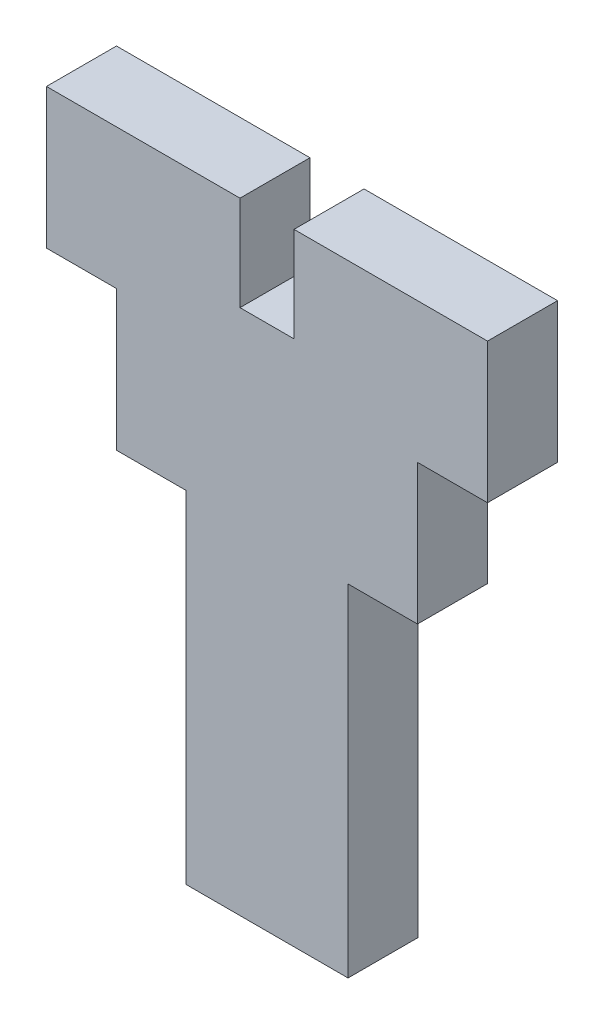
ISO-10303-21;
HEADER;
FILE_DESCRIPTION(('STEP AP214'),'2;1');
FILE_NAME('part.step','',(''),(''),'','','');
FILE_SCHEMA(('AUTOMOTIVE_DESIGN { 1 0 10303 214 1 1 1 1 }'));
ENDSEC;
DATA;
#1=APPLICATION_CONTEXT('core data for automotive mechanical design processes');
#2=APPLICATION_PROTOCOL_DEFINITION('international standard','automotive_design',2000,#1);
#3=PRODUCT_CONTEXT('',#1,'mechanical');
#4=PRODUCT('Part','Part','',(#3));
#5=PRODUCT_RELATED_PRODUCT_CATEGORY('part','',(#4));
#6=PRODUCT_DEFINITION_FORMATION('','',#4);
#7=PRODUCT_DEFINITION_CONTEXT('part definition',#1,'design');
#8=PRODUCT_DEFINITION('design','',#6,#7);
#9=PRODUCT_DEFINITION_SHAPE('','',#8);
#10=(LENGTH_UNIT() NAMED_UNIT(*) SI_UNIT(.MILLI.,.METRE.));
#11=(NAMED_UNIT(*) PLANE_ANGLE_UNIT() SI_UNIT($,.RADIAN.));
#12=(NAMED_UNIT(*) SI_UNIT($,.STERADIAN.) SOLID_ANGLE_UNIT());
#13=UNCERTAINTY_MEASURE_WITH_UNIT(LENGTH_MEASURE(1.E-05),#10,'distance_accuracy_value','');
#14=(GEOMETRIC_REPRESENTATION_CONTEXT(3) GLOBAL_UNCERTAINTY_ASSIGNED_CONTEXT((#13)) GLOBAL_UNIT_ASSIGNED_CONTEXT((#10,
#11,#12)) REPRESENTATION_CONTEXT('',''));
#15=CARTESIAN_POINT('',(0.,0.,0.));
#16=DIRECTION('',(0.,0.,1.));
#17=DIRECTION('',(1.,0.,0.));
#18=AXIS2_PLACEMENT_3D('',#15,#16,#17);
#19=CARTESIAN_POINT('',(0.,-19.05,0.));
#20=DIRECTION('',(0.,1.,0.));
#21=DIRECTION('',(0.,0.,1.));
#22=AXIS2_PLACEMENT_3D('',#19,#20,#21);
#23=PLANE('',#22);
#24=DIRECTION('',(0.,0.,1.));
#25=VECTOR('',#24,1.);
#26=CARTESIAN_POINT('',(7.35,-19.05,0.));
#27=LINE('',#26,#25);
#28=CARTESIAN_POINT('',(7.35,-19.05,0.));
#29=VERTEX_POINT('',#28);
#30=CARTESIAN_POINT('',(7.35,-19.05,6.35));
#31=VERTEX_POINT('',#30);
#32=EDGE_CURVE('E50',#29,#31,#27,.T.);
#33=ORIENTED_EDGE('',*,*,#32,.F.);
#34=DIRECTION('',(1.,0.,0.));
#35=VECTOR('',#34,1.);
#36=CARTESIAN_POINT('',(-13.65,-19.05,0.));
#37=LINE('',#36,#35);
#38=CARTESIAN_POINT('',(13.65,-19.05,0.));
#39=VERTEX_POINT('',#38);
#40=EDGE_CURVE('E194',#29,#39,#37,.T.);
#41=ORIENTED_EDGE('',*,*,#40,.T.);
#42=DIRECTION('',(0.,0.,1.));
#43=VECTOR('',#42,1.);
#44=CARTESIAN_POINT('',(13.65,-19.05,0.));
#45=LINE('',#44,#43);
#46=CARTESIAN_POINT('',(13.65,-19.05,6.35));
#47=VERTEX_POINT('',#46);
#48=EDGE_CURVE('E230',#39,#47,#45,.T.);
#49=ORIENTED_EDGE('',*,*,#48,.T.);
#50=DIRECTION('',(-1.,0.,0.));
#51=VECTOR('',#50,1.);
#52=CARTESIAN_POINT('',(-13.65,-19.05,6.35));
#53=LINE('',#52,#51);
#54=EDGE_CURVE('E215',#47,#31,#53,.T.);
#55=ORIENTED_EDGE('',*,*,#54,.T.);
#56=EDGE_LOOP('',(#33,#41,#49,#55));
#57=FACE_BOUND('',#56,.T.);
#58=ADVANCED_FACE('F33',(#57),#23,.F.);
#59=DIRECTION('',(0.,0.,-1.));
#60=VECTOR('',#59,1.);
#61=CARTESIAN_POINT('',(-7.35,-19.05,0.));
#62=LINE('',#61,#60);
#63=CARTESIAN_POINT('',(-7.35,-19.05,6.35));
#64=VERTEX_POINT('',#63);
#65=CARTESIAN_POINT('',(-7.35,-19.05,0.));
#66=VERTEX_POINT('',#65);
#67=EDGE_CURVE('E58',#64,#66,#62,.T.);
#68=ORIENTED_EDGE('',*,*,#67,.F.);
#69=CARTESIAN_POINT('',(-13.65,-19.05,6.35));
#70=VERTEX_POINT('',#69);
#71=EDGE_CURVE('E219',#64,#70,#53,.T.);
#72=ORIENTED_EDGE('',*,*,#71,.T.);
#73=DIRECTION('',(0.,0.,-1.));
#74=VECTOR('',#73,1.);
#75=CARTESIAN_POINT('',(-13.65,-19.05,0.));
#76=LINE('',#75,#74);
#77=CARTESIAN_POINT('',(-13.65,-19.05,0.));
#78=VERTEX_POINT('',#77);
#79=EDGE_CURVE('E214',#70,#78,#76,.T.);
#80=ORIENTED_EDGE('',*,*,#79,.T.);
#81=EDGE_CURVE('E213',#78,#66,#37,.T.);
#82=ORIENTED_EDGE('',*,*,#81,.T.);
#83=EDGE_LOOP('',(#68,#72,#80,#82));
#84=FACE_BOUND('',#83,.T.);
#85=ADVANCED_FACE('F356',(#84),#23,.F.);
#86=CARTESIAN_POINT('',(-20.,6.35,6.35));
#87=DIRECTION('',(0.,-1.,0.));
#88=DIRECTION('',(0.,0.,-1.));
#89=AXIS2_PLACEMENT_3D('',#86,#87,#88);
#90=PLANE('',#89);
#91=DIRECTION('',(-1.,0.,0.));
#92=VECTOR('',#91,1.);
#93=CARTESIAN_POINT('',(-20.,6.35,0.));
#94=LINE('',#93,#92);
#95=CARTESIAN_POINT('',(20.,6.35,0.));
#96=VERTEX_POINT('',#95);
#97=CARTESIAN_POINT('',(2.45,6.35,0.));
#98=VERTEX_POINT('',#97);
#99=EDGE_CURVE('E305',#96,#98,#94,.T.);
#100=ORIENTED_EDGE('',*,*,#99,.T.);
#101=DIRECTION('',(0.,0.,-1.));
#102=VECTOR('',#101,1.);
#103=CARTESIAN_POINT('',(2.45,6.35,6.35));
#104=LINE('',#103,#102);
#105=CARTESIAN_POINT('',(2.45,6.35,6.35));
#106=VERTEX_POINT('',#105);
#107=EDGE_CURVE('E170',#106,#98,#104,.T.);
#108=ORIENTED_EDGE('',*,*,#107,.F.);
#109=DIRECTION('',(-1.,0.,0.));
#110=VECTOR('',#109,1.);
#111=CARTESIAN_POINT('',(-20.,6.35,6.35));
#112=LINE('',#111,#110);
#113=CARTESIAN_POINT('',(20.,6.35,6.35));
#114=VERTEX_POINT('',#113);
#115=EDGE_CURVE('E268',#114,#106,#112,.T.);
#116=ORIENTED_EDGE('',*,*,#115,.F.);
#117=DIRECTION('',(0.,0.,-1.));
#118=VECTOR('',#117,1.);
#119=CARTESIAN_POINT('',(20.,6.35,6.35));
#120=LINE('',#119,#118);
#121=EDGE_CURVE('E11',#114,#96,#120,.T.);
#122=ORIENTED_EDGE('',*,*,#121,.T.);
#123=EDGE_LOOP('',(#100,#108,#116,#122));
#124=FACE_BOUND('',#123,.T.);
#125=ADVANCED_FACE('F319',(#124),#90,.F.);
#126=CARTESIAN_POINT('',(-20.,-6.35,6.35));
#127=DIRECTION('',(0.,1.,0.));
#128=DIRECTION('',(0.,0.,1.));
#129=AXIS2_PLACEMENT_3D('',#126,#127,#128);
#130=PLANE('',#129);
#131=DIRECTION('',(0.,0.,1.));
#132=VECTOR('',#131,1.);
#133=CARTESIAN_POINT('',(13.65,-6.35,0.));
#134=LINE('',#133,#132);
#135=CARTESIAN_POINT('',(13.65,-6.35,0.));
#136=VERTEX_POINT('',#135);
#137=CARTESIAN_POINT('',(13.65,-6.35,6.35));
#138=VERTEX_POINT('',#137);
#139=EDGE_CURVE('E236',#136,#138,#134,.T.);
#140=ORIENTED_EDGE('',*,*,#139,.F.);
#141=DIRECTION('',(1.,0.,0.));
#142=VECTOR('',#141,1.);
#143=CARTESIAN_POINT('',(-20.,-6.35,0.));
#144=LINE('',#143,#142);
#145=CARTESIAN_POINT('',(20.,-6.35,0.));
#146=VERTEX_POINT('',#145);
#147=EDGE_CURVE('E279',#136,#146,#144,.T.);
#148=ORIENTED_EDGE('',*,*,#147,.T.);
#149=DIRECTION('',(0.,0.,-1.));
#150=VECTOR('',#149,1.);
#151=CARTESIAN_POINT('',(20.,-6.35,6.35));
#152=LINE('',#151,#150);
#153=CARTESIAN_POINT('',(20.,-6.35,6.35));
#154=VERTEX_POINT('',#153);
#155=EDGE_CURVE('E278',#154,#146,#152,.T.);
#156=ORIENTED_EDGE('',*,*,#155,.F.);
#157=DIRECTION('',(1.,0.,0.));
#158=VECTOR('',#157,1.);
#159=CARTESIAN_POINT('',(-20.,-6.35,6.35));
#160=LINE('',#159,#158);
#161=EDGE_CURVE('E258',#138,#154,#160,.T.);
#162=ORIENTED_EDGE('',*,*,#161,.F.);
#163=EDGE_LOOP('',(#140,#148,#156,#162));
#164=FACE_BOUND('',#163,.T.);
#165=ADVANCED_FACE('F323',(#164),#130,.F.);
#166=DIRECTION('',(0.,0.,-1.));
#167=VECTOR('',#166,1.);
#168=CARTESIAN_POINT('',(-13.65,-6.35,0.));
#169=LINE('',#168,#167);
#170=CARTESIAN_POINT('',(-13.65,-6.35,6.35));
#171=VERTEX_POINT('',#170);
#172=CARTESIAN_POINT('',(-13.65,-6.35,0.));
#173=VERTEX_POINT('',#172);
#174=EDGE_CURVE('E239',#171,#173,#169,.T.);
#175=ORIENTED_EDGE('',*,*,#174,.F.);
#176=CARTESIAN_POINT('',(-20.,-6.35,6.35));
#177=VERTEX_POINT('',#176);
#178=EDGE_CURVE('E275',#177,#171,#160,.T.);
#179=ORIENTED_EDGE('',*,*,#178,.F.);
#180=DIRECTION('',(0.,0.,-1.));
#181=VECTOR('',#180,1.);
#182=CARTESIAN_POINT('',(-20.,-6.35,6.35));
#183=LINE('',#182,#181);
#184=CARTESIAN_POINT('',(-20.,-6.35,0.));
#185=VERTEX_POINT('',#184);
#186=EDGE_CURVE('E289',#177,#185,#183,.T.);
#187=ORIENTED_EDGE('',*,*,#186,.T.);
#188=EDGE_CURVE('E267',#185,#173,#144,.T.);
#189=ORIENTED_EDGE('',*,*,#188,.T.);
#190=EDGE_LOOP('',(#175,#179,#187,#189));
#191=FACE_BOUND('',#190,.T.);
#192=ADVANCED_FACE('F353',(#191),#130,.F.);
#193=CARTESIAN_POINT('',(20.,-6.35,6.35));
#194=DIRECTION('',(-1.,0.,0.));
#195=DIRECTION('',(0.,0.,1.));
#196=AXIS2_PLACEMENT_3D('',#193,#194,#195);
#197=PLANE('',#196);
#198=DIRECTION('',(0.,1.,0.));
#199=VECTOR('',#198,1.);
#200=CARTESIAN_POINT('',(20.,-6.35,0.));
#201=LINE('',#200,#199);
#202=EDGE_CURVE('E246',#146,#96,#201,.T.);
#203=ORIENTED_EDGE('',*,*,#202,.T.);
#204=ORIENTED_EDGE('',*,*,#121,.F.);
#205=DIRECTION('',(0.,1.,0.));
#206=VECTOR('',#205,1.);
#207=CARTESIAN_POINT('',(20.,-6.35,6.35));
#208=LINE('',#207,#206);
#209=EDGE_CURVE('E263',#154,#114,#208,.T.);
#210=ORIENTED_EDGE('',*,*,#209,.F.);
#211=ORIENTED_EDGE('',*,*,#155,.T.);
#212=EDGE_LOOP('',(#203,#204,#210,#211));
#213=FACE_BOUND('',#212,.T.);
#214=ADVANCED_FACE('F35',(#213),#197,.F.);
#215=CARTESIAN_POINT('',(-2.45,6.35,6.35));
#216=VERTEX_POINT('',#215);
#217=CARTESIAN_POINT('',(-20.,6.35,6.35));
#218=VERTEX_POINT('',#217);
#219=EDGE_CURVE('E266',#216,#218,#112,.T.);
#220=ORIENTED_EDGE('',*,*,#219,.F.);
#221=DIRECTION('',(0.,0.,1.));
#222=VECTOR('',#221,1.);
#223=CARTESIAN_POINT('',(-2.45,6.35,6.35));
#224=LINE('',#223,#222);
#225=CARTESIAN_POINT('',(-2.45,6.35,0.));
#226=VERTEX_POINT('',#225);
#227=EDGE_CURVE('E172',#226,#216,#224,.T.);
#228=ORIENTED_EDGE('',*,*,#227,.F.);
#229=CARTESIAN_POINT('',(-20.,6.35,0.));
#230=VERTEX_POINT('',#229);
#231=EDGE_CURVE('E304',#226,#230,#94,.T.);
#232=ORIENTED_EDGE('',*,*,#231,.T.);
#233=DIRECTION('',(0.,0.,-1.));
#234=VECTOR('',#233,1.);
#235=CARTESIAN_POINT('',(-20.,6.35,6.35));
#236=LINE('',#235,#234);
#237=EDGE_CURVE('E42',#218,#230,#236,.T.);
#238=ORIENTED_EDGE('',*,*,#237,.F.);
#239=EDGE_LOOP('',(#220,#228,#232,#238));
#240=FACE_BOUND('',#239,.T.);
#241=ADVANCED_FACE('F349',(#240),#90,.F.);
#242=CARTESIAN_POINT('',(-20.,-6.35,6.35));
#243=DIRECTION('',(1.,0.,0.));
#244=DIRECTION('',(0.,0.,-1.));
#245=AXIS2_PLACEMENT_3D('',#242,#243,#244);
#246=PLANE('',#245);
#247=DIRECTION('',(0.,-1.,0.));
#248=VECTOR('',#247,1.);
#249=CARTESIAN_POINT('',(-20.,-6.35,0.));
#250=LINE('',#249,#248);
#251=EDGE_CURVE('E282',#230,#185,#250,.T.);
#252=ORIENTED_EDGE('',*,*,#251,.T.);
#253=ORIENTED_EDGE('',*,*,#186,.F.);
#254=DIRECTION('',(0.,-1.,0.));
#255=VECTOR('',#254,1.);
#256=CARTESIAN_POINT('',(-20.,-6.35,6.35));
#257=LINE('',#256,#255);
#258=EDGE_CURVE('E270',#218,#177,#257,.T.);
#259=ORIENTED_EDGE('',*,*,#258,.F.);
#260=ORIENTED_EDGE('',*,*,#237,.T.);
#261=EDGE_LOOP('',(#252,#253,#259,#260));
#262=FACE_BOUND('',#261,.T.);
#263=ADVANCED_FACE('F297',(#262),#246,.F.);
#264=CARTESIAN_POINT('',(0.,0.,6.35));
#265=DIRECTION('',(0.,0.,-1.));
#266=DIRECTION('',(-1.,0.,0.));
#267=AXIS2_PLACEMENT_3D('',#264,#265,#266);
#268=PLANE('',#267);
#269=ORIENTED_EDGE('',*,*,#115,.T.);
#270=DIRECTION('',(0.,1.,0.));
#271=VECTOR('',#270,1.);
#272=CARTESIAN_POINT('',(2.45,-2.25,6.35));
#273=LINE('',#272,#271);
#274=CARTESIAN_POINT('',(2.45,-2.25,6.35));
#275=VERTEX_POINT('',#274);
#276=EDGE_CURVE('E240',#275,#106,#273,.T.);
#277=ORIENTED_EDGE('',*,*,#276,.F.);
#278=DIRECTION('',(1.,0.,0.));
#279=VECTOR('',#278,1.);
#280=CARTESIAN_POINT('',(-2.45,-2.25,6.35));
#281=LINE('',#280,#279);
#282=CARTESIAN_POINT('',(-2.45,-2.25,6.35));
#283=VERTEX_POINT('',#282);
#284=EDGE_CURVE('E329',#283,#275,#281,.T.);
#285=ORIENTED_EDGE('',*,*,#284,.F.);
#286=DIRECTION('',(0.,1.,0.));
#287=VECTOR('',#286,1.);
#288=CARTESIAN_POINT('',(-2.45,-2.25,6.35));
#289=LINE('',#288,#287);
#290=EDGE_CURVE('E331',#283,#216,#289,.T.);
#291=ORIENTED_EDGE('',*,*,#290,.T.);
#292=ORIENTED_EDGE('',*,*,#219,.T.);
#293=ORIENTED_EDGE('',*,*,#258,.T.);
#294=ORIENTED_EDGE('',*,*,#178,.T.);
#295=DIRECTION('',(0.,1.,0.));
#296=VECTOR('',#295,1.);
#297=CARTESIAN_POINT('',(-13.65,-19.05,6.35));
#298=LINE('',#297,#296);
#299=EDGE_CURVE('E247',#70,#171,#298,.T.);
#300=ORIENTED_EDGE('',*,*,#299,.F.);
#301=ORIENTED_EDGE('',*,*,#71,.F.);
#302=DIRECTION('',(0.,1.,0.));
#303=VECTOR('',#302,1.);
#304=CARTESIAN_POINT('',(-7.35,-50.,6.35));
#305=LINE('',#304,#303);
#306=CARTESIAN_POINT('',(-7.35,-50.,6.35));
#307=VERTEX_POINT('',#306);
#308=EDGE_CURVE('E155',#307,#64,#305,.T.);
#309=ORIENTED_EDGE('',*,*,#308,.F.);
#310=DIRECTION('',(-1.,0.,0.));
#311=VECTOR('',#310,1.);
#312=CARTESIAN_POINT('',(-7.35,-50.,6.35));
#313=LINE('',#312,#311);
#314=CARTESIAN_POINT('',(7.35,-50.,6.35));
#315=VERTEX_POINT('',#314);
#316=EDGE_CURVE('E148',#315,#307,#313,.T.);
#317=ORIENTED_EDGE('',*,*,#316,.F.);
#318=DIRECTION('',(0.,1.,0.));
#319=VECTOR('',#318,1.);
#320=CARTESIAN_POINT('',(7.35,-50.,6.35));
#321=LINE('',#320,#319);
#322=EDGE_CURVE('E153',#315,#31,#321,.T.);
#323=ORIENTED_EDGE('',*,*,#322,.T.);
#324=ORIENTED_EDGE('',*,*,#54,.F.);
#325=DIRECTION('',(0.,1.,0.));
#326=VECTOR('',#325,1.);
#327=CARTESIAN_POINT('',(13.65,-19.05,6.35));
#328=LINE('',#327,#326);
#329=EDGE_CURVE('E243',#47,#138,#328,.T.);
#330=ORIENTED_EDGE('',*,*,#329,.T.);
#331=ORIENTED_EDGE('',*,*,#161,.T.);
#332=ORIENTED_EDGE('',*,*,#209,.T.);
#333=EDGE_LOOP('',(#269,#277,#285,#291,#292,#293,#294,#300,#301,#309,#317,#323,#324,#330,#331,#332));
#334=FACE_BOUND('',#333,.T.);
#335=ADVANCED_FACE('F151',(#334),#268,.F.);
#336=CARTESIAN_POINT('',(0.,0.,0.));
#337=DIRECTION('',(0.,0.,-1.));
#338=DIRECTION('',(-1.,0.,0.));
#339=AXIS2_PLACEMENT_3D('',#336,#337,#338);
#340=PLANE('',#339);
#341=DIRECTION('',(0.,1.,0.));
#342=VECTOR('',#341,1.);
#343=CARTESIAN_POINT('',(2.45,-2.25,0.));
#344=LINE('',#343,#342);
#345=CARTESIAN_POINT('',(2.45,-2.25,0.));
#346=VERTEX_POINT('',#345);
#347=EDGE_CURVE('E318',#346,#98,#344,.T.);
#348=ORIENTED_EDGE('',*,*,#347,.T.);
#349=ORIENTED_EDGE('',*,*,#99,.F.);
#350=ORIENTED_EDGE('',*,*,#202,.F.);
#351=ORIENTED_EDGE('',*,*,#147,.F.);
#352=DIRECTION('',(0.,1.,0.));
#353=VECTOR('',#352,1.);
#354=CARTESIAN_POINT('',(13.65,-19.05,0.));
#355=LINE('',#354,#353);
#356=EDGE_CURVE('E210',#39,#136,#355,.T.);
#357=ORIENTED_EDGE('',*,*,#356,.F.);
#358=ORIENTED_EDGE('',*,*,#40,.F.);
#359=DIRECTION('',(0.,1.,0.));
#360=VECTOR('',#359,1.);
#361=CARTESIAN_POINT('',(7.35,-50.,0.));
#362=LINE('',#361,#360);
#363=CARTESIAN_POINT('',(7.35,-50.,0.));
#364=VERTEX_POINT('',#363);
#365=EDGE_CURVE('E182',#364,#29,#362,.T.);
#366=ORIENTED_EDGE('',*,*,#365,.F.);
#367=DIRECTION('',(1.,0.,0.));
#368=VECTOR('',#367,1.);
#369=CARTESIAN_POINT('',(-7.35,-50.,0.));
#370=LINE('',#369,#368);
#371=CARTESIAN_POINT('',(-7.35,-50.,0.));
#372=VERTEX_POINT('',#371);
#373=EDGE_CURVE('E164',#372,#364,#370,.T.);
#374=ORIENTED_EDGE('',*,*,#373,.F.);
#375=DIRECTION('',(0.,1.,0.));
#376=VECTOR('',#375,1.);
#377=CARTESIAN_POINT('',(-7.35,-50.,0.));
#378=LINE('',#377,#376);
#379=EDGE_CURVE('E174',#372,#66,#378,.T.);
#380=ORIENTED_EDGE('',*,*,#379,.T.);
#381=ORIENTED_EDGE('',*,*,#81,.F.);
#382=DIRECTION('',(0.,1.,0.));
#383=VECTOR('',#382,1.);
#384=CARTESIAN_POINT('',(-13.65,-19.05,0.));
#385=LINE('',#384,#383);
#386=EDGE_CURVE('E235',#78,#173,#385,.T.);
#387=ORIENTED_EDGE('',*,*,#386,.T.);
#388=ORIENTED_EDGE('',*,*,#188,.F.);
#389=ORIENTED_EDGE('',*,*,#251,.F.);
#390=ORIENTED_EDGE('',*,*,#231,.F.);
#391=DIRECTION('',(0.,1.,0.));
#392=VECTOR('',#391,1.);
#393=CARTESIAN_POINT('',(-2.45,-2.25,0.));
#394=LINE('',#393,#392);
#395=CARTESIAN_POINT('',(-2.45,-2.25,0.));
#396=VERTEX_POINT('',#395);
#397=EDGE_CURVE('E328',#396,#226,#394,.T.);
#398=ORIENTED_EDGE('',*,*,#397,.F.);
#399=DIRECTION('',(-1.,0.,0.));
#400=VECTOR('',#399,1.);
#401=CARTESIAN_POINT('',(-2.45,-2.25,0.));
#402=LINE('',#401,#400);
#403=EDGE_CURVE('E340',#346,#396,#402,.T.);
#404=ORIENTED_EDGE('',*,*,#403,.F.);
#405=EDGE_LOOP('',(#348,#349,#350,#351,#357,#358,#366,#374,#380,#381,#387,#388,#389,#390,#398,#404));
#406=FACE_BOUND('',#405,.T.);
#407=ADVANCED_FACE('F206',(#406),#340,.T.);
#408=CARTESIAN_POINT('',(13.65,-19.05,0.));
#409=DIRECTION('',(-1.,0.,0.));
#410=DIRECTION('',(0.,0.,1.));
#411=AXIS2_PLACEMENT_3D('',#408,#409,#410);
#412=PLANE('',#411);
#413=ORIENTED_EDGE('',*,*,#139,.T.);
#414=ORIENTED_EDGE('',*,*,#329,.F.);
#415=ORIENTED_EDGE('',*,*,#48,.F.);
#416=ORIENTED_EDGE('',*,*,#356,.T.);
#417=EDGE_LOOP('',(#413,#414,#415,#416));
#418=FACE_BOUND('',#417,.T.);
#419=ADVANCED_FACE('F325',(#418),#412,.F.);
#420=CARTESIAN_POINT('',(-13.65,-19.05,0.));
#421=DIRECTION('',(1.,0.,0.));
#422=DIRECTION('',(0.,0.,-1.));
#423=AXIS2_PLACEMENT_3D('',#420,#421,#422);
#424=PLANE('',#423);
#425=ORIENTED_EDGE('',*,*,#174,.T.);
#426=ORIENTED_EDGE('',*,*,#386,.F.);
#427=ORIENTED_EDGE('',*,*,#79,.F.);
#428=ORIENTED_EDGE('',*,*,#299,.T.);
#429=EDGE_LOOP('',(#425,#426,#427,#428));
#430=FACE_BOUND('',#429,.T.);
#431=ADVANCED_FACE('F355',(#430),#424,.F.);
#432=CARTESIAN_POINT('',(2.45,-2.25,6.35));
#433=DIRECTION('',(1.,0.,0.));
#434=DIRECTION('',(0.,0.,-1.));
#435=AXIS2_PLACEMENT_3D('',#432,#433,#434);
#436=PLANE('',#435);
#437=ORIENTED_EDGE('',*,*,#107,.T.);
#438=ORIENTED_EDGE('',*,*,#347,.F.);
#439=DIRECTION('',(0.,0.,-1.));
#440=VECTOR('',#439,1.);
#441=CARTESIAN_POINT('',(2.45,-2.25,6.35));
#442=LINE('',#441,#440);
#443=EDGE_CURVE('E189',#275,#346,#442,.T.);
#444=ORIENTED_EDGE('',*,*,#443,.F.);
#445=ORIENTED_EDGE('',*,*,#276,.T.);
#446=EDGE_LOOP('',(#437,#438,#444,#445));
#447=FACE_BOUND('',#446,.T.);
#448=ADVANCED_FACE('F346',(#447),#436,.F.);
#449=CARTESIAN_POINT('',(-2.45,-2.25,6.35));
#450=DIRECTION('',(-1.,0.,0.));
#451=DIRECTION('',(0.,0.,1.));
#452=AXIS2_PLACEMENT_3D('',#449,#450,#451);
#453=PLANE('',#452);
#454=ORIENTED_EDGE('',*,*,#227,.T.);
#455=ORIENTED_EDGE('',*,*,#290,.F.);
#456=DIRECTION('',(0.,0.,1.));
#457=VECTOR('',#456,1.);
#458=CARTESIAN_POINT('',(-2.45,-2.25,6.35));
#459=LINE('',#458,#457);
#460=EDGE_CURVE('E338',#396,#283,#459,.T.);
#461=ORIENTED_EDGE('',*,*,#460,.F.);
#462=ORIENTED_EDGE('',*,*,#397,.T.);
#463=EDGE_LOOP('',(#454,#455,#461,#462));
#464=FACE_BOUND('',#463,.T.);
#465=ADVANCED_FACE('F348',(#464),#453,.F.);
#466=CARTESIAN_POINT('',(0.,-2.25,0.));
#467=DIRECTION('',(0.,-1.,0.));
#468=DIRECTION('',(0.,0.,-1.));
#469=AXIS2_PLACEMENT_3D('',#466,#467,#468);
#470=PLANE('',#469);
#471=ORIENTED_EDGE('',*,*,#443,.T.);
#472=ORIENTED_EDGE('',*,*,#403,.T.);
#473=ORIENTED_EDGE('',*,*,#460,.T.);
#474=ORIENTED_EDGE('',*,*,#284,.T.);
#475=EDGE_LOOP('',(#471,#472,#473,#474));
#476=FACE_BOUND('',#475,.T.);
#477=ADVANCED_FACE('F343',(#476),#470,.F.);
#478=CARTESIAN_POINT('',(7.35,-50.,0.));
#479=DIRECTION('',(-1.,0.,0.));
#480=DIRECTION('',(0.,0.,1.));
#481=AXIS2_PLACEMENT_3D('',#478,#479,#480);
#482=PLANE('',#481);
#483=ORIENTED_EDGE('',*,*,#32,.T.);
#484=ORIENTED_EDGE('',*,*,#322,.F.);
#485=DIRECTION('',(0.,0.,1.));
#486=VECTOR('',#485,1.);
#487=CARTESIAN_POINT('',(7.35,-50.,0.));
#488=LINE('',#487,#486);
#489=EDGE_CURVE('E159',#364,#315,#488,.T.);
#490=ORIENTED_EDGE('',*,*,#489,.F.);
#491=ORIENTED_EDGE('',*,*,#365,.T.);
#492=EDGE_LOOP('',(#483,#484,#490,#491));
#493=FACE_BOUND('',#492,.T.);
#494=ADVANCED_FACE('F169',(#493),#482,.F.);
#495=CARTESIAN_POINT('',(-7.35,-50.,0.));
#496=DIRECTION('',(1.,0.,0.));
#497=DIRECTION('',(0.,0.,-1.));
#498=AXIS2_PLACEMENT_3D('',#495,#496,#497);
#499=PLANE('',#498);
#500=ORIENTED_EDGE('',*,*,#67,.T.);
#501=ORIENTED_EDGE('',*,*,#379,.F.);
#502=DIRECTION('',(0.,0.,-1.));
#503=VECTOR('',#502,1.);
#504=CARTESIAN_POINT('',(-7.35,-50.,0.));
#505=LINE('',#504,#503);
#506=EDGE_CURVE('E158',#307,#372,#505,.T.);
#507=ORIENTED_EDGE('',*,*,#506,.F.);
#508=ORIENTED_EDGE('',*,*,#308,.T.);
#509=EDGE_LOOP('',(#500,#501,#507,#508));
#510=FACE_BOUND('',#509,.T.);
#511=ADVANCED_FACE('F204',(#510),#499,.F.);
#512=CARTESIAN_POINT('',(0.,-50.,0.));
#513=DIRECTION('',(0.,1.,0.));
#514=DIRECTION('',(0.,0.,1.));
#515=AXIS2_PLACEMENT_3D('',#512,#513,#514);
#516=PLANE('',#515);
#517=ORIENTED_EDGE('',*,*,#489,.T.);
#518=ORIENTED_EDGE('',*,*,#316,.T.);
#519=ORIENTED_EDGE('',*,*,#506,.T.);
#520=ORIENTED_EDGE('',*,*,#373,.T.);
#521=EDGE_LOOP('',(#517,#518,#519,#520));
#522=FACE_BOUND('',#521,.T.);
#523=ADVANCED_FACE('F162',(#522),#516,.F.);
#524=CLOSED_SHELL('',(#58,#85,#125,#165,#192,#214,#241,#263,#335,#407,#419,#431,#448,#465,#477,
#494,#511,#523));
#525=MANIFOLD_SOLID_BREP('B2',#524);
#526=ADVANCED_BREP_SHAPE_REPRESENTATION('',(#18,#525),#14);
#527=SHAPE_DEFINITION_REPRESENTATION(#9,#526);
ENDSEC;
END-ISO-10303-21;
